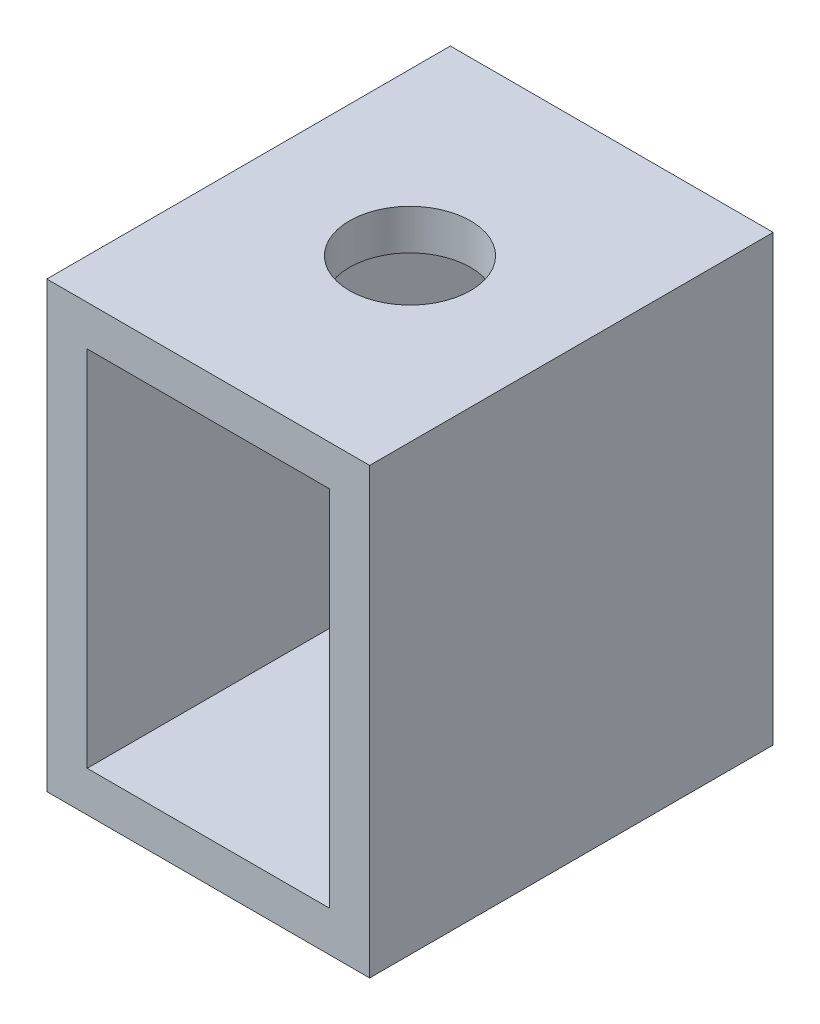
ISO-10303-21;
HEADER;
FILE_DESCRIPTION(('STEP AP214'),'2;1');
FILE_NAME('part.step','',(''),(''),'','','');
FILE_SCHEMA(('AUTOMOTIVE_DESIGN { 1 0 10303 214 1 1 1 1 }'));
ENDSEC;
DATA;
#1=APPLICATION_CONTEXT('core data for automotive mechanical design processes');
#2=APPLICATION_PROTOCOL_DEFINITION('international standard','automotive_design',2000,#1);
#3=PRODUCT_CONTEXT('',#1,'mechanical');
#4=PRODUCT('Part','Part','',(#3));
#5=PRODUCT_RELATED_PRODUCT_CATEGORY('part','',(#4));
#6=PRODUCT_DEFINITION_FORMATION('','',#4);
#7=PRODUCT_DEFINITION_CONTEXT('part definition',#1,'design');
#8=PRODUCT_DEFINITION('design','',#6,#7);
#9=PRODUCT_DEFINITION_SHAPE('','',#8);
#10=(LENGTH_UNIT() NAMED_UNIT(*) SI_UNIT(.MILLI.,.METRE.));
#11=(NAMED_UNIT(*) PLANE_ANGLE_UNIT() SI_UNIT($,.RADIAN.));
#12=(NAMED_UNIT(*) SI_UNIT($,.STERADIAN.) SOLID_ANGLE_UNIT());
#13=UNCERTAINTY_MEASURE_WITH_UNIT(LENGTH_MEASURE(1.E-05),#10,'distance_accuracy_value','');
#14=(GEOMETRIC_REPRESENTATION_CONTEXT(3) GLOBAL_UNCERTAINTY_ASSIGNED_CONTEXT((#13)) GLOBAL_UNIT_ASSIGNED_CONTEXT((#10,
#11,#12)) REPRESENTATION_CONTEXT('',''));
#15=CARTESIAN_POINT('',(0.,0.,0.));
#16=DIRECTION('',(0.,0.,1.));
#17=DIRECTION('',(1.,0.,0.));
#18=AXIS2_PLACEMENT_3D('',#15,#16,#17);
#19=CARTESIAN_POINT('',(0.,0.,5.));
#20=DIRECTION('',(0.,0.,1.));
#21=DIRECTION('',(1.,0.,0.));
#22=AXIS2_PLACEMENT_3D('',#19,#20,#21);
#23=PLANE('',#22);
#24=DIRECTION('',(0.,-1.,0.));
#25=VECTOR('',#24,1.);
#26=CARTESIAN_POINT('',(-0.5,0.,5.));
#27=LINE('',#26,#25);
#28=CARTESIAN_POINT('',(-0.5,5.,5.));
#29=VERTEX_POINT('',#28);
#30=CARTESIAN_POINT('',(-0.5,-0.5,5.));
#31=VERTEX_POINT('',#30);
#32=EDGE_CURVE('E159',#29,#31,#27,.T.);
#33=ORIENTED_EDGE('',*,*,#32,.T.);
#34=DIRECTION('',(1.,0.,0.));
#35=VECTOR('',#34,1.);
#36=CARTESIAN_POINT('',(0.,-0.5,5.));
#37=LINE('',#36,#35);
#38=CARTESIAN_POINT('',(3.5,-0.5,5.));
#39=VERTEX_POINT('',#38);
#40=EDGE_CURVE('E162',#31,#39,#37,.T.);
#41=ORIENTED_EDGE('',*,*,#40,.T.);
#42=DIRECTION('',(0.,1.,0.));
#43=VECTOR('',#42,1.);
#44=CARTESIAN_POINT('',(3.5,0.,5.));
#45=LINE('',#44,#43);
#46=CARTESIAN_POINT('',(3.5,5.,5.));
#47=VERTEX_POINT('',#46);
#48=EDGE_CURVE('E165',#39,#47,#45,.T.);
#49=ORIENTED_EDGE('',*,*,#48,.T.);
#50=DIRECTION('',(-1.,0.,0.));
#51=VECTOR('',#50,1.);
#52=CARTESIAN_POINT('',(0.,5.,5.));
#53=LINE('',#52,#51);
#54=EDGE_CURVE('E167',#47,#29,#53,.T.);
#55=ORIENTED_EDGE('',*,*,#54,.T.);
#56=EDGE_LOOP('',(#33,#41,#49,#55));
#57=FACE_BOUND('',#56,.T.);
#58=DIRECTION('',(1.,0.,0.));
#59=VECTOR('',#58,1.);
#60=CARTESIAN_POINT('',(0.,0.,5.));
#61=LINE('',#60,#59);
#62=CARTESIAN_POINT('',(0.,0.,5.));
#63=VERTEX_POINT('',#62);
#64=CARTESIAN_POINT('',(3.,0.,5.));
#65=VERTEX_POINT('',#64);
#66=EDGE_CURVE('E129',#63,#65,#61,.T.);
#67=ORIENTED_EDGE('',*,*,#66,.F.);
#68=DIRECTION('',(0.,-1.,0.));
#69=VECTOR('',#68,1.);
#70=CARTESIAN_POINT('',(0.,0.,5.));
#71=LINE('',#70,#69);
#72=CARTESIAN_POINT('',(0.,4.5,5.));
#73=VERTEX_POINT('',#72);
#74=EDGE_CURVE('E121',#73,#63,#71,.T.);
#75=ORIENTED_EDGE('',*,*,#74,.F.);
#76=DIRECTION('',(-1.,0.,0.));
#77=VECTOR('',#76,1.);
#78=CARTESIAN_POINT('',(0.,4.5,5.));
#79=LINE('',#78,#77);
#80=CARTESIAN_POINT('',(3.,4.5,5.));
#81=VERTEX_POINT('',#80);
#82=EDGE_CURVE('E143',#81,#73,#79,.T.);
#83=ORIENTED_EDGE('',*,*,#82,.F.);
#84=DIRECTION('',(0.,1.,0.));
#85=VECTOR('',#84,1.);
#86=CARTESIAN_POINT('',(3.,0.,5.));
#87=LINE('',#86,#85);
#88=EDGE_CURVE('E141',#65,#81,#87,.T.);
#89=ORIENTED_EDGE('',*,*,#88,.F.);
#90=EDGE_LOOP('',(#67,#75,#83,#89));
#91=FACE_BOUND('',#90,.T.);
#92=ADVANCED_FACE('F56',(#57,#91),#23,.T.);
#93=CARTESIAN_POINT('',(0.,0.,0.));
#94=DIRECTION('',(0.,0.,1.));
#95=DIRECTION('',(1.,0.,0.));
#96=AXIS2_PLACEMENT_3D('',#93,#94,#95);
#97=PLANE('',#96);
#98=DIRECTION('',(0.,-1.,0.));
#99=VECTOR('',#98,1.);
#100=CARTESIAN_POINT('',(-0.5,0.,0.));
#101=LINE('',#100,#99);
#102=CARTESIAN_POINT('',(-0.5,5.,0.));
#103=VERTEX_POINT('',#102);
#104=CARTESIAN_POINT('',(-0.5,-0.5,0.));
#105=VERTEX_POINT('',#104);
#106=EDGE_CURVE('E137',#103,#105,#101,.T.);
#107=ORIENTED_EDGE('',*,*,#106,.F.);
#108=DIRECTION('',(-1.,0.,0.));
#109=VECTOR('',#108,1.);
#110=CARTESIAN_POINT('',(0.,5.,0.));
#111=LINE('',#110,#109);
#112=CARTESIAN_POINT('',(3.5,5.,0.));
#113=VERTEX_POINT('',#112);
#114=EDGE_CURVE('E163',#113,#103,#111,.T.);
#115=ORIENTED_EDGE('',*,*,#114,.F.);
#116=DIRECTION('',(0.,1.,0.));
#117=VECTOR('',#116,1.);
#118=CARTESIAN_POINT('',(3.5,0.,0.));
#119=LINE('',#118,#117);
#120=CARTESIAN_POINT('',(3.5,-0.5,0.));
#121=VERTEX_POINT('',#120);
#122=EDGE_CURVE('E174',#121,#113,#119,.T.);
#123=ORIENTED_EDGE('',*,*,#122,.F.);
#124=DIRECTION('',(1.,0.,0.));
#125=VECTOR('',#124,1.);
#126=CARTESIAN_POINT('',(0.,-0.5,0.));
#127=LINE('',#126,#125);
#128=EDGE_CURVE('E172',#105,#121,#127,.T.);
#129=ORIENTED_EDGE('',*,*,#128,.F.);
#130=EDGE_LOOP('',(#107,#115,#123,#129));
#131=FACE_BOUND('',#130,.T.);
#132=DIRECTION('',(0.,-1.,0.));
#133=VECTOR('',#132,1.);
#134=CARTESIAN_POINT('',(0.,0.,0.));
#135=LINE('',#134,#133);
#136=CARTESIAN_POINT('',(0.,4.5,0.));
#137=VERTEX_POINT('',#136);
#138=CARTESIAN_POINT('',(0.,0.,0.));
#139=VERTEX_POINT('',#138);
#140=EDGE_CURVE('E79',#137,#139,#135,.T.);
#141=ORIENTED_EDGE('',*,*,#140,.T.);
#142=DIRECTION('',(1.,0.,0.));
#143=VECTOR('',#142,1.);
#144=CARTESIAN_POINT('',(0.,0.,0.));
#145=LINE('',#144,#143);
#146=CARTESIAN_POINT('',(3.,0.,0.));
#147=VERTEX_POINT('',#146);
#148=EDGE_CURVE('E136',#139,#147,#145,.T.);
#149=ORIENTED_EDGE('',*,*,#148,.T.);
#150=DIRECTION('',(0.,1.,0.));
#151=VECTOR('',#150,1.);
#152=CARTESIAN_POINT('',(3.,0.,0.));
#153=LINE('',#152,#151);
#154=CARTESIAN_POINT('',(3.,4.5,0.));
#155=VERTEX_POINT('',#154);
#156=EDGE_CURVE('E151',#147,#155,#153,.T.);
#157=ORIENTED_EDGE('',*,*,#156,.T.);
#158=DIRECTION('',(-1.,0.,0.));
#159=VECTOR('',#158,1.);
#160=CARTESIAN_POINT('',(0.,4.5,0.));
#161=LINE('',#160,#159);
#162=EDGE_CURVE('E130',#155,#137,#161,.T.);
#163=ORIENTED_EDGE('',*,*,#162,.T.);
#164=EDGE_LOOP('',(#141,#149,#157,#163));
#165=FACE_BOUND('',#164,.T.);
#166=ADVANCED_FACE('F192',(#131,#165),#97,.F.);
#167=CARTESIAN_POINT('',(-0.5,0.,5.));
#168=DIRECTION('',(1.,0.,0.));
#169=DIRECTION('',(0.,0.,-1.));
#170=AXIS2_PLACEMENT_3D('',#167,#168,#169);
#171=PLANE('',#170);
#172=ORIENTED_EDGE('',*,*,#106,.T.);
#173=DIRECTION('',(0.,0.,-1.));
#174=VECTOR('',#173,1.);
#175=CARTESIAN_POINT('',(-0.5,-0.5,5.));
#176=LINE('',#175,#174);
#177=EDGE_CURVE('E12',#31,#105,#176,.T.);
#178=ORIENTED_EDGE('',*,*,#177,.F.);
#179=ORIENTED_EDGE('',*,*,#32,.F.);
#180=DIRECTION('',(0.,0.,-1.));
#181=VECTOR('',#180,1.);
#182=CARTESIAN_POINT('',(-0.5,5.,5.));
#183=LINE('',#182,#181);
#184=EDGE_CURVE('E169',#29,#103,#183,.T.);
#185=ORIENTED_EDGE('',*,*,#184,.T.);
#186=EDGE_LOOP('',(#172,#178,#179,#185));
#187=FACE_BOUND('',#186,.T.);
#188=ADVANCED_FACE('F58',(#187),#171,.F.);
#189=CARTESIAN_POINT('',(0.,-0.5,5.));
#190=DIRECTION('',(0.,1.,0.));
#191=DIRECTION('',(0.,0.,1.));
#192=AXIS2_PLACEMENT_3D('',#189,#190,#191);
#193=PLANE('',#192);
#194=ORIENTED_EDGE('',*,*,#128,.T.);
#195=DIRECTION('',(0.,0.,-1.));
#196=VECTOR('',#195,1.);
#197=CARTESIAN_POINT('',(3.5,-0.5,5.));
#198=LINE('',#197,#196);
#199=EDGE_CURVE('E64',#39,#121,#198,.T.);
#200=ORIENTED_EDGE('',*,*,#199,.F.);
#201=ORIENTED_EDGE('',*,*,#40,.F.);
#202=ORIENTED_EDGE('',*,*,#177,.T.);
#203=EDGE_LOOP('',(#194,#200,#201,#202));
#204=FACE_BOUND('',#203,.T.);
#205=ADVANCED_FACE('F202',(#204),#193,.F.);
#206=CARTESIAN_POINT('',(3.5,0.,5.));
#207=DIRECTION('',(-1.,0.,0.));
#208=DIRECTION('',(0.,0.,1.));
#209=AXIS2_PLACEMENT_3D('',#206,#207,#208);
#210=PLANE('',#209);
#211=ORIENTED_EDGE('',*,*,#122,.T.);
#212=DIRECTION('',(0.,0.,-1.));
#213=VECTOR('',#212,1.);
#214=CARTESIAN_POINT('',(3.5,5.,5.));
#215=LINE('',#214,#213);
#216=EDGE_CURVE('E179',#47,#113,#215,.T.);
#217=ORIENTED_EDGE('',*,*,#216,.F.);
#218=ORIENTED_EDGE('',*,*,#48,.F.);
#219=ORIENTED_EDGE('',*,*,#199,.T.);
#220=EDGE_LOOP('',(#211,#217,#218,#219));
#221=FACE_BOUND('',#220,.T.);
#222=ADVANCED_FACE('F186',(#221),#210,.F.);
#223=CARTESIAN_POINT('',(0.,5.,5.));
#224=DIRECTION('',(0.,-1.,0.));
#225=DIRECTION('',(0.,0.,-1.));
#226=AXIS2_PLACEMENT_3D('',#223,#224,#225);
#227=PLANE('',#226);
#228=CARTESIAN_POINT('',(1.5,5.,2.5));
#229=DIRECTION('',(0.,1.,0.));
#230=DIRECTION('',(0.,0.,1.));
#231=AXIS2_PLACEMENT_3D('',#228,#229,#230);
#232=CIRCLE('',#231,0.75);
#233=CARTESIAN_POINT('',(1.5,5.,3.25));
#234=VERTEX_POINT('',#233);
#235=EDGE_CURVE('E149',#234,#234,#232,.T.);
#236=ORIENTED_EDGE('',*,*,#235,.F.);
#237=EDGE_LOOP('',(#236));
#238=FACE_BOUND('',#237,.T.);
#239=ORIENTED_EDGE('',*,*,#114,.T.);
#240=ORIENTED_EDGE('',*,*,#184,.F.);
#241=ORIENTED_EDGE('',*,*,#54,.F.);
#242=ORIENTED_EDGE('',*,*,#216,.T.);
#243=EDGE_LOOP('',(#239,#240,#241,#242));
#244=FACE_BOUND('',#243,.T.);
#245=ADVANCED_FACE('F196',(#238,#244),#227,.F.);
#246=CARTESIAN_POINT('',(0.,0.,5.));
#247=DIRECTION('',(1.,0.,0.));
#248=DIRECTION('',(0.,0.,-1.));
#249=AXIS2_PLACEMENT_3D('',#246,#247,#248);
#250=PLANE('',#249);
#251=ORIENTED_EDGE('',*,*,#140,.F.);
#252=DIRECTION('',(0.,0.,-1.));
#253=VECTOR('',#252,1.);
#254=CARTESIAN_POINT('',(0.,4.5,5.));
#255=LINE('',#254,#253);
#256=EDGE_CURVE('E125',#73,#137,#255,.T.);
#257=ORIENTED_EDGE('',*,*,#256,.F.);
#258=ORIENTED_EDGE('',*,*,#74,.T.);
#259=DIRECTION('',(0.,0.,-1.));
#260=VECTOR('',#259,1.);
#261=CARTESIAN_POINT('',(0.,0.,5.));
#262=LINE('',#261,#260);
#263=EDGE_CURVE('E124',#63,#139,#262,.T.);
#264=ORIENTED_EDGE('',*,*,#263,.T.);
#265=EDGE_LOOP('',(#251,#257,#258,#264));
#266=FACE_BOUND('',#265,.T.);
#267=ADVANCED_FACE('F123',(#266),#250,.T.);
#268=CARTESIAN_POINT('',(0.,0.,5.));
#269=DIRECTION('',(0.,1.,0.));
#270=DIRECTION('',(0.,0.,1.));
#271=AXIS2_PLACEMENT_3D('',#268,#269,#270);
#272=PLANE('',#271);
#273=ORIENTED_EDGE('',*,*,#148,.F.);
#274=ORIENTED_EDGE('',*,*,#263,.F.);
#275=ORIENTED_EDGE('',*,*,#66,.T.);
#276=DIRECTION('',(0.,0.,-1.));
#277=VECTOR('',#276,1.);
#278=CARTESIAN_POINT('',(3.,0.,5.));
#279=LINE('',#278,#277);
#280=EDGE_CURVE('E138',#65,#147,#279,.T.);
#281=ORIENTED_EDGE('',*,*,#280,.T.);
#282=EDGE_LOOP('',(#273,#274,#275,#281));
#283=FACE_BOUND('',#282,.T.);
#284=ADVANCED_FACE('F133',(#283),#272,.T.);
#285=CARTESIAN_POINT('',(3.,0.,5.));
#286=DIRECTION('',(-1.,0.,0.));
#287=DIRECTION('',(0.,0.,1.));
#288=AXIS2_PLACEMENT_3D('',#285,#286,#287);
#289=PLANE('',#288);
#290=ORIENTED_EDGE('',*,*,#156,.F.);
#291=ORIENTED_EDGE('',*,*,#280,.F.);
#292=ORIENTED_EDGE('',*,*,#88,.T.);
#293=DIRECTION('',(0.,0.,-1.));
#294=VECTOR('',#293,1.);
#295=CARTESIAN_POINT('',(3.,4.5,5.));
#296=LINE('',#295,#294);
#297=EDGE_CURVE('E71',#81,#155,#296,.T.);
#298=ORIENTED_EDGE('',*,*,#297,.T.);
#299=EDGE_LOOP('',(#290,#291,#292,#298));
#300=FACE_BOUND('',#299,.T.);
#301=ADVANCED_FACE('F239',(#300),#289,.T.);
#302=CARTESIAN_POINT('',(0.,4.5,5.));
#303=DIRECTION('',(0.,-1.,0.));
#304=DIRECTION('',(0.,0.,-1.));
#305=AXIS2_PLACEMENT_3D('',#302,#303,#304);
#306=PLANE('',#305);
#307=CARTESIAN_POINT('',(1.5,4.5,2.5));
#308=DIRECTION('',(0.,-1.,0.));
#309=DIRECTION('',(0.,0.,-1.));
#310=AXIS2_PLACEMENT_3D('',#307,#308,#309);
#311=CIRCLE('',#310,0.75);
#312=CARTESIAN_POINT('',(1.5,4.5,1.75));
#313=VERTEX_POINT('',#312);
#314=EDGE_CURVE('E226',#313,#313,#311,.F.);
#315=ORIENTED_EDGE('',*,*,#314,.T.);
#316=EDGE_LOOP('',(#315));
#317=FACE_BOUND('',#316,.T.);
#318=ORIENTED_EDGE('',*,*,#162,.F.);
#319=ORIENTED_EDGE('',*,*,#297,.F.);
#320=ORIENTED_EDGE('',*,*,#82,.T.);
#321=ORIENTED_EDGE('',*,*,#256,.T.);
#322=EDGE_LOOP('',(#318,#319,#320,#321));
#323=FACE_BOUND('',#322,.T.);
#324=ADVANCED_FACE('F231',(#317,#323),#306,.T.);
#325=CARTESIAN_POINT('',(1.5,-0.501,2.5));
#326=DIRECTION('',(0.,1.,0.));
#327=DIRECTION('',(0.,0.,1.));
#328=AXIS2_PLACEMENT_3D('',#325,#326,#327);
#329=CYLINDRICAL_SURFACE('',#328,0.75);
#330=ORIENTED_EDGE('',*,*,#314,.F.);
#331=EDGE_LOOP('',(#330));
#332=FACE_BOUND('',#331,.T.);
#333=ORIENTED_EDGE('',*,*,#235,.T.);
#334=EDGE_LOOP('',(#333));
#335=FACE_BOUND('',#334,.T.);
#336=ADVANCED_FACE('F233',(#332,#335),#329,.F.);
#337=CLOSED_SHELL('',(#92,#166,#188,#205,#222,#245,#267,#284,#301,#324,#336));
#338=MANIFOLD_SOLID_BREP('B2',#337);
#339=ADVANCED_BREP_SHAPE_REPRESENTATION('',(#18,#338),#14);
#340=SHAPE_DEFINITION_REPRESENTATION(#9,#339);
ENDSEC;
END-ISO-10303-21;
